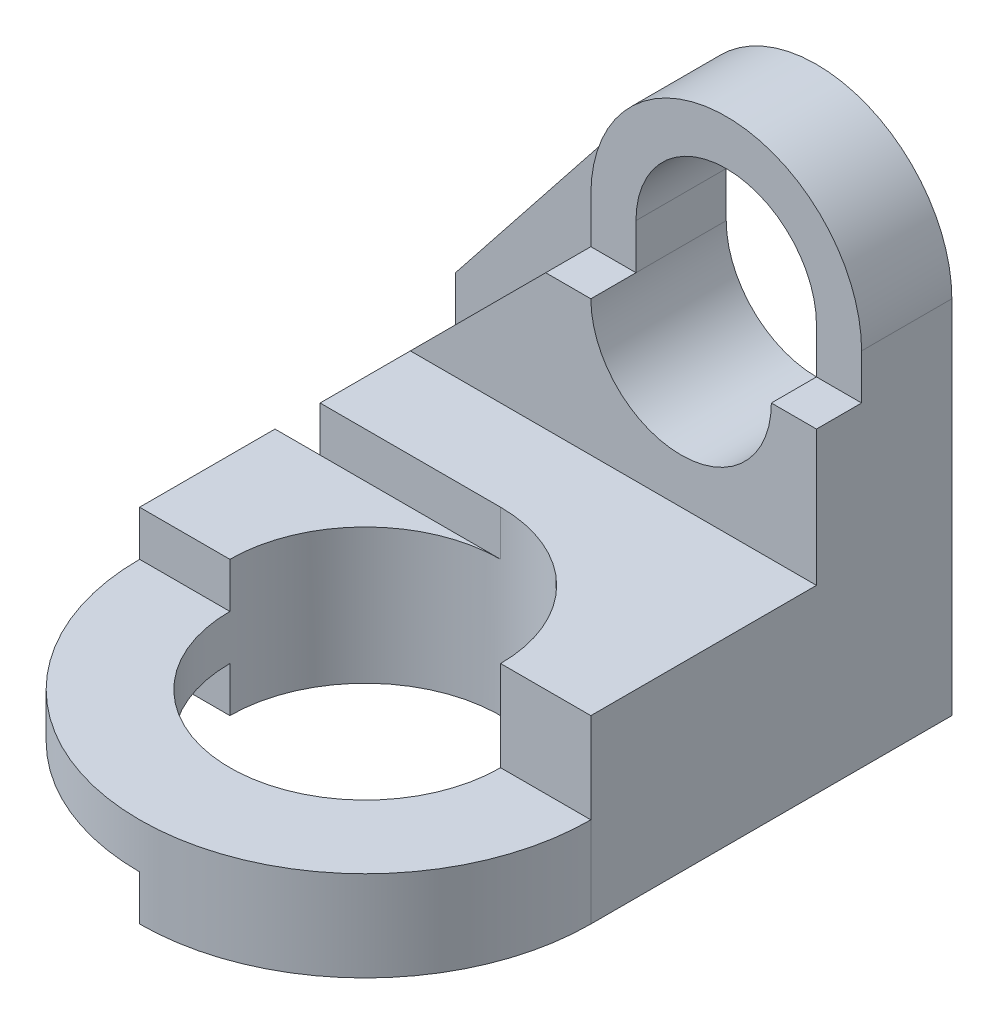
ISO-10303-21;
HEADER;
FILE_DESCRIPTION(('STEP AP214'),'2;1');
FILE_NAME('part.step','',(''),(''),'','','');
FILE_SCHEMA(('AUTOMOTIVE_DESIGN { 1 0 10303 214 1 1 1 1 }'));
ENDSEC;
DATA;
#1=APPLICATION_CONTEXT('core data for automotive mechanical design processes');
#2=APPLICATION_PROTOCOL_DEFINITION('international standard','automotive_design',2000,#1);
#3=PRODUCT_CONTEXT('',#1,'mechanical');
#4=PRODUCT('Part','Part','',(#3));
#5=PRODUCT_RELATED_PRODUCT_CATEGORY('part','',(#4));
#6=PRODUCT_DEFINITION_FORMATION('','',#4);
#7=PRODUCT_DEFINITION_CONTEXT('part definition',#1,'design');
#8=PRODUCT_DEFINITION('design','',#6,#7);
#9=PRODUCT_DEFINITION_SHAPE('','',#8);
#10=(LENGTH_UNIT() NAMED_UNIT(*) SI_UNIT(.MILLI.,.METRE.));
#11=(NAMED_UNIT(*) PLANE_ANGLE_UNIT() SI_UNIT($,.RADIAN.));
#12=(NAMED_UNIT(*) SI_UNIT($,.STERADIAN.) SOLID_ANGLE_UNIT());
#13=UNCERTAINTY_MEASURE_WITH_UNIT(LENGTH_MEASURE(1.E-05),#10,'distance_accuracy_value','');
#14=(GEOMETRIC_REPRESENTATION_CONTEXT(3) GLOBAL_UNCERTAINTY_ASSIGNED_CONTEXT((#13)) GLOBAL_UNIT_ASSIGNED_CONTEXT((#10,
#11,#12)) REPRESENTATION_CONTEXT('',''));
#15=CARTESIAN_POINT('',(0.,0.,0.));
#16=DIRECTION('',(0.,0.,1.));
#17=DIRECTION('',(1.,0.,0.));
#18=AXIS2_PLACEMENT_3D('',#15,#16,#17);
#19=CARTESIAN_POINT('',(0.,3.,13.));
#20=DIRECTION('',(0.,-1.,0.));
#21=DIRECTION('',(0.,0.,-1.));
#22=AXIS2_PLACEMENT_3D('',#19,#20,#21);
#23=PLANE('',#22);
#24=DIRECTION('',(0.,0.,-1.));
#25=VECTOR('',#24,1.);
#26=CARTESIAN_POINT('',(0.,3.,13.));
#27=LINE('',#26,#25);
#28=CARTESIAN_POINT('',(0.,3.,8.00000000000004));
#29=VERTEX_POINT('',#28);
#30=CARTESIAN_POINT('',(0.,3.,5.));
#31=VERTEX_POINT('',#30);
#32=EDGE_CURVE('E592',#29,#31,#27,.T.);
#33=ORIENTED_EDGE('',*,*,#32,.F.);
#34=DIRECTION('',(-1.,0.,0.));
#35=VECTOR('',#34,1.);
#36=CARTESIAN_POINT('',(0.,3.,8.00000000000004));
#37=LINE('',#36,#35);
#38=CARTESIAN_POINT('',(2.,3.,8.));
#39=VERTEX_POINT('',#38);
#40=EDGE_CURVE('E262',#39,#29,#37,.T.);
#41=ORIENTED_EDGE('',*,*,#40,.F.);
#42=CARTESIAN_POINT('',(5.,3.,8.));
#43=DIRECTION('',(0.,-1.,0.));
#44=DIRECTION('',(0.,0.,-1.));
#45=AXIS2_PLACEMENT_3D('',#42,#43,#44);
#46=CIRCLE('',#45,3.);
#47=CARTESIAN_POINT('',(4.99999999999999,3.,5.));
#48=VERTEX_POINT('',#47);
#49=EDGE_CURVE('E292',#39,#48,#46,.T.);
#50=ORIENTED_EDGE('',*,*,#49,.T.);
#51=DIRECTION('',(-1.,0.,0.));
#52=VECTOR('',#51,1.);
#53=CARTESIAN_POINT('',(0.,3.,5.));
#54=LINE('',#53,#52);
#55=CARTESIAN_POINT('',(1.,3.,5.));
#56=VERTEX_POINT('',#55);
#57=EDGE_CURVE('E54',#48,#56,#54,.T.);
#58=ORIENTED_EDGE('',*,*,#57,.T.);
#59=EDGE_CURVE('E317',#56,#31,#54,.T.);
#60=ORIENTED_EDGE('',*,*,#59,.T.);
#61=EDGE_LOOP('',(#33,#41,#50,#58,#60));
#62=FACE_BOUND('',#61,.T.);
#63=ADVANCED_FACE('F50',(#62),#23,.F.);
#64=CARTESIAN_POINT('',(5.,-4.,8.));
#65=DIRECTION('',(0.,1.,0.));
#66=DIRECTION('',(0.,0.,1.));
#67=AXIS2_PLACEMENT_3D('',#64,#65,#66);
#68=CYLINDRICAL_SURFACE('',#67,5.);
#69=DIRECTION('',(0.,1.,0.));
#70=VECTOR('',#69,1.);
#71=CARTESIAN_POINT('',(10.,-4.,8.));
#72=LINE('',#71,#70);
#73=CARTESIAN_POINT('',(10.,0.,8.));
#74=VERTEX_POINT('',#73);
#75=CARTESIAN_POINT('',(10.,2.,8.));
#76=VERTEX_POINT('',#75);
#77=EDGE_CURVE('E303',#74,#76,#72,.T.);
#78=ORIENTED_EDGE('',*,*,#77,.T.);
#79=CARTESIAN_POINT('',(5.,2.,8.));
#80=DIRECTION('',(0.,1.,0.));
#81=DIRECTION('',(0.,0.,1.));
#82=AXIS2_PLACEMENT_3D('',#79,#80,#81);
#83=CIRCLE('',#82,5.);
#84=CARTESIAN_POINT('',(0.,2.,8.00000000000004));
#85=VERTEX_POINT('',#84);
#86=EDGE_CURVE('E263',#85,#76,#83,.T.);
#87=ORIENTED_EDGE('',*,*,#86,.F.);
#88=DIRECTION('',(0.,1.,0.));
#89=VECTOR('',#88,1.);
#90=CARTESIAN_POINT('',(0.,-4.,8.));
#91=LINE('',#90,#89);
#92=CARTESIAN_POINT('',(0.,1.,7.99999999999997));
#93=VERTEX_POINT('',#92);
#94=EDGE_CURVE('E302',#93,#85,#91,.T.);
#95=ORIENTED_EDGE('',*,*,#94,.F.);
#96=CARTESIAN_POINT('',(4.99999999999999,1.,8.));
#97=DIRECTION('',(0.,-1.,0.));
#98=DIRECTION('',(1.,0.,0.));
#99=AXIS2_PLACEMENT_3D('',#96,#97,#98);
#100=CIRCLE('',#99,5.);
#101=CARTESIAN_POINT('',(5.,1.,13.));
#102=VERTEX_POINT('',#101);
#103=EDGE_CURVE('E277',#102,#93,#100,.T.);
#104=ORIENTED_EDGE('',*,*,#103,.F.);
#105=DIRECTION('',(0.,-1.,0.));
#106=VECTOR('',#105,1.);
#107=CARTESIAN_POINT('',(5.,1.,13.));
#108=LINE('',#107,#106);
#109=CARTESIAN_POINT('',(5.,0.,13.));
#110=VERTEX_POINT('',#109);
#111=EDGE_CURVE('E289',#102,#110,#108,.T.);
#112=ORIENTED_EDGE('',*,*,#111,.T.);
#113=CARTESIAN_POINT('',(5.,0.,8.));
#114=DIRECTION('',(0.,-1.,0.));
#115=DIRECTION('',(1.,0.,0.));
#116=AXIS2_PLACEMENT_3D('',#113,#114,#115);
#117=CIRCLE('',#116,5.);
#118=EDGE_CURVE('E306',#74,#110,#117,.T.);
#119=ORIENTED_EDGE('',*,*,#118,.F.);
#120=EDGE_LOOP('',(#78,#87,#95,#104,#112,#119));
#121=FACE_BOUND('',#120,.T.);
#122=ADVANCED_FACE('F539',(#121),#68,.T.);
#123=CARTESIAN_POINT('',(0.,0.,1.));
#124=DIRECTION('',(0.,-1.,0.));
#125=DIRECTION('',(1.,0.,0.));
#126=AXIS2_PLACEMENT_3D('',#123,#124,#125);
#127=PLANE('',#126);
#128=DIRECTION('',(0.,0.,1.));
#129=VECTOR('',#128,1.);
#130=CARTESIAN_POINT('',(5.,0.,11.));
#131=LINE('',#130,#129);
#132=CARTESIAN_POINT('',(5.,0.,11.));
#133=VERTEX_POINT('',#132);
#134=EDGE_CURVE('E279',#133,#110,#131,.T.);
#135=ORIENTED_EDGE('',*,*,#134,.F.);
#136=CARTESIAN_POINT('',(5.,0.,8.));
#137=DIRECTION('',(0.,-1.,0.));
#138=DIRECTION('',(1.,0.,0.));
#139=AXIS2_PLACEMENT_3D('',#136,#137,#138);
#140=CIRCLE('',#139,3.);
#141=CARTESIAN_POINT('',(2.,0.,8.));
#142=VERTEX_POINT('',#141);
#143=EDGE_CURVE('E299',#142,#133,#140,.T.);
#144=ORIENTED_EDGE('',*,*,#143,.F.);
#145=DIRECTION('',(1.,0.,0.));
#146=VECTOR('',#145,1.);
#147=CARTESIAN_POINT('',(2.,0.,8.));
#148=LINE('',#147,#146);
#149=CARTESIAN_POINT('',(0.,0.,7.99999999999997));
#150=VERTEX_POINT('',#149);
#151=EDGE_CURVE('E274',#150,#142,#148,.T.);
#152=ORIENTED_EDGE('',*,*,#151,.F.);
#153=DIRECTION('',(0.,0.,-1.));
#154=VECTOR('',#153,1.);
#155=CARTESIAN_POINT('',(0.,0.,13.));
#156=LINE('',#155,#154);
#157=CARTESIAN_POINT('',(0.,0.,5.));
#158=VERTEX_POINT('',#157);
#159=EDGE_CURVE('E324',#150,#158,#156,.T.);
#160=ORIENTED_EDGE('',*,*,#159,.T.);
#161=DIRECTION('',(1.,0.,0.));
#162=VECTOR('',#161,1.);
#163=CARTESIAN_POINT('',(0.,0.,5.));
#164=LINE('',#163,#162);
#165=CARTESIAN_POINT('',(1.,0.,5.));
#166=VERTEX_POINT('',#165);
#167=EDGE_CURVE('E315',#158,#166,#164,.T.);
#168=ORIENTED_EDGE('',*,*,#167,.T.);
#169=DIRECTION('',(0.,0.,-1.));
#170=VECTOR('',#169,1.);
#171=CARTESIAN_POINT('',(1.,0.,3.));
#172=LINE('',#171,#170);
#173=CARTESIAN_POINT('',(1.,0.,1.));
#174=VERTEX_POINT('',#173);
#175=EDGE_CURVE('E358',#166,#174,#172,.T.);
#176=ORIENTED_EDGE('',*,*,#175,.T.);
#177=DIRECTION('',(-1.,0.,0.));
#178=VECTOR('',#177,1.);
#179=CARTESIAN_POINT('',(0.,0.,1.));
#180=LINE('',#179,#178);
#181=CARTESIAN_POINT('',(0.,0.,1.));
#182=VERTEX_POINT('',#181);
#183=EDGE_CURVE('E391',#174,#182,#180,.T.);
#184=ORIENTED_EDGE('',*,*,#183,.T.);
#185=DIRECTION('',(0.,0.,-1.));
#186=VECTOR('',#185,1.);
#187=CARTESIAN_POINT('',(0.,0.,1.));
#188=LINE('',#187,#186);
#189=CARTESIAN_POINT('',(0.,0.,0.));
#190=VERTEX_POINT('',#189);
#191=EDGE_CURVE('E430',#182,#190,#188,.T.);
#192=ORIENTED_EDGE('',*,*,#191,.T.);
#193=DIRECTION('',(-1.,0.,0.));
#194=VECTOR('',#193,1.);
#195=CARTESIAN_POINT('',(0.,0.,0.));
#196=LINE('',#195,#194);
#197=CARTESIAN_POINT('',(10.,0.,0.));
#198=VERTEX_POINT('',#197);
#199=EDGE_CURVE('E380',#198,#190,#196,.T.);
#200=ORIENTED_EDGE('',*,*,#199,.F.);
#201=DIRECTION('',(0.,0.,-1.));
#202=VECTOR('',#201,1.);
#203=CARTESIAN_POINT('',(10.,0.,1.));
#204=LINE('',#203,#202);
#205=EDGE_CURVE('E428',#74,#198,#204,.T.);
#206=ORIENTED_EDGE('',*,*,#205,.F.);
#207=ORIENTED_EDGE('',*,*,#118,.T.);
#208=EDGE_LOOP('',(#135,#144,#152,#160,#168,#176,#184,#192,#200,#206,#207));
#209=FACE_BOUND('',#208,.T.);
#210=ADVANCED_FACE('F546',(#209),#127,.T.);
#211=CARTESIAN_POINT('',(0.,0.,1.));
#212=DIRECTION('',(0.,0.,1.));
#213=DIRECTION('',(1.,0.,0.));
#214=AXIS2_PLACEMENT_3D('',#211,#212,#213);
#215=PLANE('',#214);
#216=ORIENTED_EDGE('',*,*,#183,.F.);
#217=DIRECTION('',(0.,1.,0.));
#218=VECTOR('',#217,1.);
#219=CARTESIAN_POINT('',(1.,0.,1.));
#220=LINE('',#219,#218);
#221=CARTESIAN_POINT('',(1.,4.,1.));
#222=VERTEX_POINT('',#221);
#223=EDGE_CURVE('E346',#174,#222,#220,.T.);
#224=ORIENTED_EDGE('',*,*,#223,.T.);
#225=DIRECTION('',(0.707106781186547,0.707106781186548,0.));
#226=VECTOR('',#225,1.);
#227=CARTESIAN_POINT('',(-1.5,1.5,1.));
#228=LINE('',#227,#226);
#229=CARTESIAN_POINT('',(4.,7.,1.));
#230=VERTEX_POINT('',#229);
#231=EDGE_CURVE('E362',#222,#230,#228,.T.);
#232=ORIENTED_EDGE('',*,*,#231,.T.);
#233=DIRECTION('',(0.,1.,0.));
#234=VECTOR('',#233,1.);
#235=CARTESIAN_POINT('',(3.99999999999999,0.,1.));
#236=LINE('',#235,#234);
#237=CARTESIAN_POINT('',(4.,8.,1.));
#238=VERTEX_POINT('',#237);
#239=EDGE_CURVE('E359',#230,#238,#236,.T.);
#240=ORIENTED_EDGE('',*,*,#239,.T.);
#241=CARTESIAN_POINT('',(7.,8.,1.));
#242=DIRECTION('',(0.,0.,1.));
#243=DIRECTION('',(1.,0.,0.));
#244=AXIS2_PLACEMENT_3D('',#241,#242,#243);
#245=CIRCLE('',#244,2.99999999999999);
#246=CARTESIAN_POINT('',(4.6492341956527,9.86384015760778,1.));
#247=VERTEX_POINT('',#246);
#248=EDGE_CURVE('E60',#247,#238,#245,.T.);
#249=ORIENTED_EDGE('',*,*,#248,.F.);
#250=DIRECTION('',(0.621280052535926,0.7835886014491,0.));
#251=VECTOR('',#250,1.);
#252=CARTESIAN_POINT('',(-1.9473118698994,1.54395561471617,1.));
#253=LINE('',#252,#251);
#254=CARTESIAN_POINT('',(0.,4.,1.));
#255=VERTEX_POINT('',#254);
#256=EDGE_CURVE('E376',#255,#247,#253,.T.);
#257=ORIENTED_EDGE('',*,*,#256,.F.);
#258=DIRECTION('',(0.,1.,0.));
#259=VECTOR('',#258,1.);
#260=CARTESIAN_POINT('',(0.,0.,1.));
#261=LINE('',#260,#259);
#262=EDGE_CURVE('E379',#182,#255,#261,.T.);
#263=ORIENTED_EDGE('',*,*,#262,.F.);
#264=EDGE_LOOP('',(#216,#224,#232,#240,#249,#257,#263));
#265=FACE_BOUND('',#264,.T.);
#266=ADVANCED_FACE('F509',(#265),#215,.T.);
#267=CARTESIAN_POINT('',(10.,0.,1.));
#268=DIRECTION('',(1.,0.,0.));
#269=DIRECTION('',(0.,1.,0.));
#270=AXIS2_PLACEMENT_3D('',#267,#268,#269);
#271=PLANE('',#270);
#272=ORIENTED_EDGE('',*,*,#77,.F.);
#273=ORIENTED_EDGE('',*,*,#205,.T.);
#274=DIRECTION('',(0.,-1.,0.));
#275=VECTOR('',#274,1.);
#276=CARTESIAN_POINT('',(10.,0.,0.));
#277=LINE('',#276,#275);
#278=CARTESIAN_POINT('',(9.99999999999999,8.,0.));
#279=VERTEX_POINT('',#278);
#280=EDGE_CURVE('E414',#279,#198,#277,.T.);
#281=ORIENTED_EDGE('',*,*,#280,.F.);
#282=DIRECTION('',(0.,0.,-1.));
#283=VECTOR('',#282,1.);
#284=CARTESIAN_POINT('',(9.99999999999999,8.,1.));
#285=LINE('',#284,#283);
#286=CARTESIAN_POINT('',(9.99999999999999,8.,2.));
#287=VERTEX_POINT('',#286);
#288=EDGE_CURVE('E385',#287,#279,#285,.T.);
#289=ORIENTED_EDGE('',*,*,#288,.F.);
#290=DIRECTION('',(0.,1.,0.));
#291=VECTOR('',#290,1.);
#292=CARTESIAN_POINT('',(10.,0.,2.));
#293=LINE('',#292,#291);
#294=CARTESIAN_POINT('',(9.99999999999999,7.,2.));
#295=VERTEX_POINT('',#294);
#296=EDGE_CURVE('E351',#295,#287,#293,.T.);
#297=ORIENTED_EDGE('',*,*,#296,.F.);
#298=DIRECTION('',(0.,0.,-1.));
#299=VECTOR('',#298,1.);
#300=CARTESIAN_POINT('',(9.99999999999999,7.,1.));
#301=LINE('',#300,#299);
#302=CARTESIAN_POINT('',(10.,7.,3.));
#303=VERTEX_POINT('',#302);
#304=EDGE_CURVE('E464',#303,#295,#301,.T.);
#305=ORIENTED_EDGE('',*,*,#304,.F.);
#306=DIRECTION('',(0.,1.,0.));
#307=VECTOR('',#306,1.);
#308=CARTESIAN_POINT('',(10.,0.,3.));
#309=LINE('',#308,#307);
#310=CARTESIAN_POINT('',(9.99999999999999,4.,3.));
#311=VERTEX_POINT('',#310);
#312=EDGE_CURVE('E343',#311,#303,#309,.T.);
#313=ORIENTED_EDGE('',*,*,#312,.F.);
#314=DIRECTION('',(0.,0.,-1.));
#315=VECTOR('',#314,1.);
#316=CARTESIAN_POINT('',(10.,4.,5.));
#317=LINE('',#316,#315);
#318=CARTESIAN_POINT('',(10.,4.,8.));
#319=VERTEX_POINT('',#318);
#320=EDGE_CURVE('E336',#319,#311,#317,.T.);
#321=ORIENTED_EDGE('',*,*,#320,.F.);
#322=DIRECTION('',(0.,1.,0.));
#323=VECTOR('',#322,1.);
#324=CARTESIAN_POINT('',(10.,2.,8.));
#325=LINE('',#324,#323);
#326=EDGE_CURVE('E243',#76,#319,#325,.T.);
#327=ORIENTED_EDGE('',*,*,#326,.F.);
#328=EDGE_LOOP('',(#272,#273,#281,#289,#297,#305,#313,#321,#327));
#329=FACE_BOUND('',#328,.T.);
#330=ADVANCED_FACE('F496',(#329),#271,.T.);
#331=CARTESIAN_POINT('',(7.,8.,1.));
#332=DIRECTION('',(0.,0.,-1.));
#333=DIRECTION('',(-1.,0.,0.));
#334=AXIS2_PLACEMENT_3D('',#331,#332,#333);
#335=CYLINDRICAL_SURFACE('',#334,2.99999999999999);
#336=DIRECTION('',(0.,0.,-1.));
#337=VECTOR('',#336,1.);
#338=CARTESIAN_POINT('',(4.,8.,3.));
#339=LINE('',#338,#337);
#340=CARTESIAN_POINT('',(4.,8.,2.));
#341=VERTEX_POINT('',#340);
#342=EDGE_CURVE('E405',#341,#238,#339,.T.);
#343=ORIENTED_EDGE('',*,*,#342,.F.);
#344=CARTESIAN_POINT('',(7.,8.,2.));
#345=DIRECTION('',(0.,0.,-1.));
#346=DIRECTION('',(-1.,0.,0.));
#347=AXIS2_PLACEMENT_3D('',#344,#345,#346);
#348=CIRCLE('',#347,2.99999999999999);
#349=EDGE_CURVE('E468',#341,#287,#348,.T.);
#350=ORIENTED_EDGE('',*,*,#349,.T.);
#351=ORIENTED_EDGE('',*,*,#288,.T.);
#352=CARTESIAN_POINT('',(7.,8.,0.));
#353=DIRECTION('',(0.,0.,1.));
#354=DIRECTION('',(1.,0.,0.));
#355=AXIS2_PLACEMENT_3D('',#352,#353,#354);
#356=CIRCLE('',#355,2.99999999999999);
#357=CARTESIAN_POINT('',(4.6492341956527,9.86384015760778,0.));
#358=VERTEX_POINT('',#357);
#359=EDGE_CURVE('E417',#279,#358,#356,.T.);
#360=ORIENTED_EDGE('',*,*,#359,.T.);
#361=DIRECTION('',(0.,0.,-1.));
#362=VECTOR('',#361,1.);
#363=CARTESIAN_POINT('',(4.6492341956527,9.86384015760778,1.));
#364=LINE('',#363,#362);
#365=EDGE_CURVE('E383',#247,#358,#364,.T.);
#366=ORIENTED_EDGE('',*,*,#365,.F.);
#367=ORIENTED_EDGE('',*,*,#248,.T.);
#368=EDGE_LOOP('',(#343,#350,#351,#360,#366,#367));
#369=FACE_BOUND('',#368,.T.);
#370=ADVANCED_FACE('F500',(#369),#335,.T.);
#371=CARTESIAN_POINT('',(-1.9473118698994,1.54395561471617,1.));
#372=DIRECTION('',(-0.7835886014491,0.621280052535926,0.));
#373=DIRECTION('',(-0.621280052535926,-0.7835886014491,0.));
#374=AXIS2_PLACEMENT_3D('',#371,#372,#373);
#375=PLANE('',#374);
#376=DIRECTION('',(0.621280052535926,0.7835886014491,0.));
#377=VECTOR('',#376,1.);
#378=CARTESIAN_POINT('',(-1.9473118698994,1.54395561471617,0.));
#379=LINE('',#378,#377);
#380=CARTESIAN_POINT('',(0.,4.,0.));
#381=VERTEX_POINT('',#380);
#382=EDGE_CURVE('E420',#381,#358,#379,.T.);
#383=ORIENTED_EDGE('',*,*,#382,.F.);
#384=DIRECTION('',(0.,0.,-1.));
#385=VECTOR('',#384,1.);
#386=CARTESIAN_POINT('',(0.,4.,1.));
#387=LINE('',#386,#385);
#388=EDGE_CURVE('E386',#255,#381,#387,.T.);
#389=ORIENTED_EDGE('',*,*,#388,.F.);
#390=ORIENTED_EDGE('',*,*,#256,.T.);
#391=ORIENTED_EDGE('',*,*,#365,.T.);
#392=EDGE_LOOP('',(#383,#389,#390,#391));
#393=FACE_BOUND('',#392,.T.);
#394=ADVANCED_FACE('F506',(#393),#375,.T.);
#395=CARTESIAN_POINT('',(0.,0.,1.));
#396=DIRECTION('',(-1.,0.,0.));
#397=DIRECTION('',(0.,0.,1.));
#398=AXIS2_PLACEMENT_3D('',#395,#396,#397);
#399=PLANE('',#398);
#400=DIRECTION('',(0.,1.,0.));
#401=VECTOR('',#400,1.);
#402=CARTESIAN_POINT('',(0.,0.,0.));
#403=LINE('',#402,#401);
#404=EDGE_CURVE('E423',#190,#381,#403,.T.);
#405=ORIENTED_EDGE('',*,*,#404,.F.);
#406=ORIENTED_EDGE('',*,*,#191,.F.);
#407=ORIENTED_EDGE('',*,*,#262,.T.);
#408=ORIENTED_EDGE('',*,*,#388,.T.);
#409=EDGE_LOOP('',(#405,#406,#407,#408));
#410=FACE_BOUND('',#409,.T.);
#411=ADVANCED_FACE('F585',(#410),#399,.T.);
#412=CARTESIAN_POINT('',(7.,7.,1.));
#413=DIRECTION('',(0.,0.,-1.));
#414=DIRECTION('',(-1.,0.,0.));
#415=AXIS2_PLACEMENT_3D('',#412,#413,#414);
#416=CYLINDRICAL_SURFACE('',#415,2.);
#417=CARTESIAN_POINT('',(7.,7.,0.));
#418=DIRECTION('',(0.,0.,1.));
#419=DIRECTION('',(1.,0.,0.));
#420=AXIS2_PLACEMENT_3D('',#417,#418,#419);
#421=CIRCLE('',#420,2.);
#422=CARTESIAN_POINT('',(5.,7.,0.));
#423=VERTEX_POINT('',#422);
#424=CARTESIAN_POINT('',(9.,7.,0.));
#425=VERTEX_POINT('',#424);
#426=EDGE_CURVE('E401',#423,#425,#421,.T.);
#427=ORIENTED_EDGE('',*,*,#426,.F.);
#428=DIRECTION('',(0.,0.,-1.));
#429=VECTOR('',#428,1.);
#430=CARTESIAN_POINT('',(5.,7.,1.));
#431=LINE('',#430,#429);
#432=CARTESIAN_POINT('',(5.,7.,2.));
#433=VERTEX_POINT('',#432);
#434=EDGE_CURVE('E439',#433,#423,#431,.T.);
#435=ORIENTED_EDGE('',*,*,#434,.F.);
#436=CARTESIAN_POINT('',(5.,7.,3.));
#437=VERTEX_POINT('',#436);
#438=EDGE_CURVE('E395',#437,#433,#431,.T.);
#439=ORIENTED_EDGE('',*,*,#438,.F.);
#440=CARTESIAN_POINT('',(7.,7.,3.));
#441=DIRECTION('',(0.,0.,1.));
#442=DIRECTION('',(1.,0.,0.));
#443=AXIS2_PLACEMENT_3D('',#440,#441,#442);
#444=CIRCLE('',#443,2.);
#445=CARTESIAN_POINT('',(9.,7.,3.));
#446=VERTEX_POINT('',#445);
#447=EDGE_CURVE('E355',#446,#437,#444,.F.);
#448=ORIENTED_EDGE('',*,*,#447,.F.);
#449=DIRECTION('',(0.,0.,-1.));
#450=VECTOR('',#449,1.);
#451=CARTESIAN_POINT('',(9.,7.,1.));
#452=LINE('',#451,#450);
#453=CARTESIAN_POINT('',(9.,7.,2.));
#454=VERTEX_POINT('',#453);
#455=EDGE_CURVE('E434',#446,#454,#452,.T.);
#456=ORIENTED_EDGE('',*,*,#455,.T.);
#457=EDGE_CURVE('E394',#454,#425,#452,.T.);
#458=ORIENTED_EDGE('',*,*,#457,.T.);
#459=EDGE_LOOP('',(#427,#435,#439,#448,#456,#458));
#460=FACE_BOUND('',#459,.T.);
#461=ADVANCED_FACE('F52',(#460),#416,.F.);
#462=CARTESIAN_POINT('',(5.00000000000001,0.,1.));
#463=DIRECTION('',(1.,0.,0.));
#464=DIRECTION('',(0.,1.,0.));
#465=AXIS2_PLACEMENT_3D('',#462,#463,#464);
#466=PLANE('',#465);
#467=DIRECTION('',(0.,1.,0.));
#468=VECTOR('',#467,1.);
#469=CARTESIAN_POINT('',(5.00000000000001,0.,2.));
#470=LINE('',#469,#468);
#471=CARTESIAN_POINT('',(5.,8.,2.));
#472=VERTEX_POINT('',#471);
#473=EDGE_CURVE('E461',#433,#472,#470,.T.);
#474=ORIENTED_EDGE('',*,*,#473,.F.);
#475=ORIENTED_EDGE('',*,*,#434,.T.);
#476=DIRECTION('',(0.,-1.,0.));
#477=VECTOR('',#476,1.);
#478=CARTESIAN_POINT('',(5.00000000000001,0.,0.));
#479=LINE('',#478,#477);
#480=CARTESIAN_POINT('',(5.,8.,0.));
#481=VERTEX_POINT('',#480);
#482=EDGE_CURVE('E404',#481,#423,#479,.T.);
#483=ORIENTED_EDGE('',*,*,#482,.F.);
#484=DIRECTION('',(0.,0.,-1.));
#485=VECTOR('',#484,1.);
#486=CARTESIAN_POINT('',(5.,8.,1.));
#487=LINE('',#486,#485);
#488=EDGE_CURVE('E438',#472,#481,#487,.T.);
#489=ORIENTED_EDGE('',*,*,#488,.F.);
#490=EDGE_LOOP('',(#474,#475,#483,#489));
#491=FACE_BOUND('',#490,.T.);
#492=ADVANCED_FACE('F467',(#491),#466,.T.);
#493=CARTESIAN_POINT('',(7.,8.,1.));
#494=DIRECTION('',(0.,0.,-1.));
#495=DIRECTION('',(-1.,0.,0.));
#496=AXIS2_PLACEMENT_3D('',#493,#494,#495);
#497=CYLINDRICAL_SURFACE('',#496,2.);
#498=CARTESIAN_POINT('',(7.,8.,2.));
#499=DIRECTION('',(0.,0.,-1.));
#500=DIRECTION('',(-1.,0.,0.));
#501=AXIS2_PLACEMENT_3D('',#498,#499,#500);
#502=CIRCLE('',#501,2.);
#503=CARTESIAN_POINT('',(9.,8.,2.));
#504=VERTEX_POINT('',#503);
#505=EDGE_CURVE('E469',#472,#504,#502,.T.);
#506=ORIENTED_EDGE('',*,*,#505,.F.);
#507=ORIENTED_EDGE('',*,*,#488,.T.);
#508=CARTESIAN_POINT('',(7.,8.,0.));
#509=DIRECTION('',(0.,0.,1.));
#510=DIRECTION('',(1.,0.,0.));
#511=AXIS2_PLACEMENT_3D('',#508,#509,#510);
#512=CIRCLE('',#511,2.);
#513=CARTESIAN_POINT('',(9.,8.,0.));
#514=VERTEX_POINT('',#513);
#515=EDGE_CURVE('E408',#514,#481,#512,.T.);
#516=ORIENTED_EDGE('',*,*,#515,.F.);
#517=DIRECTION('',(0.,0.,-1.));
#518=VECTOR('',#517,1.);
#519=CARTESIAN_POINT('',(9.,8.,1.));
#520=LINE('',#519,#518);
#521=EDGE_CURVE('E437',#504,#514,#520,.T.);
#522=ORIENTED_EDGE('',*,*,#521,.F.);
#523=EDGE_LOOP('',(#506,#507,#516,#522));
#524=FACE_BOUND('',#523,.T.);
#525=ADVANCED_FACE('F477',(#524),#497,.F.);
#526=CARTESIAN_POINT('',(8.99999999999999,0.,1.));
#527=DIRECTION('',(1.,0.,0.));
#528=DIRECTION('',(0.,1.,0.));
#529=AXIS2_PLACEMENT_3D('',#526,#527,#528);
#530=PLANE('',#529);
#531=ORIENTED_EDGE('',*,*,#457,.F.);
#532=DIRECTION('',(0.,1.,0.));
#533=VECTOR('',#532,1.);
#534=CARTESIAN_POINT('',(8.99999999999999,0.,2.));
#535=LINE('',#534,#533);
#536=EDGE_CURVE('E481',#454,#504,#535,.T.);
#537=ORIENTED_EDGE('',*,*,#536,.T.);
#538=ORIENTED_EDGE('',*,*,#521,.T.);
#539=DIRECTION('',(0.,-1.,0.));
#540=VECTOR('',#539,1.);
#541=CARTESIAN_POINT('',(8.99999999999999,0.,0.));
#542=LINE('',#541,#540);
#543=EDGE_CURVE('E411',#514,#425,#542,.T.);
#544=ORIENTED_EDGE('',*,*,#543,.T.);
#545=EDGE_LOOP('',(#531,#537,#538,#544));
#546=FACE_BOUND('',#545,.T.);
#547=ADVANCED_FACE('F480',(#546),#530,.F.);
#548=CARTESIAN_POINT('',(0.,0.,0.));
#549=DIRECTION('',(0.,0.,1.));
#550=DIRECTION('',(1.,0.,0.));
#551=AXIS2_PLACEMENT_3D('',#548,#549,#550);
#552=PLANE('',#551);
#553=ORIENTED_EDGE('',*,*,#426,.T.);
#554=ORIENTED_EDGE('',*,*,#543,.F.);
#555=ORIENTED_EDGE('',*,*,#515,.T.);
#556=ORIENTED_EDGE('',*,*,#482,.T.);
#557=EDGE_LOOP('',(#553,#554,#555,#556));
#558=FACE_BOUND('',#557,.T.);
#559=ORIENTED_EDGE('',*,*,#280,.T.);
#560=ORIENTED_EDGE('',*,*,#199,.T.);
#561=ORIENTED_EDGE('',*,*,#404,.T.);
#562=ORIENTED_EDGE('',*,*,#382,.T.);
#563=ORIENTED_EDGE('',*,*,#359,.F.);
#564=EDGE_LOOP('',(#559,#560,#561,#562,#563));
#565=FACE_BOUND('',#564,.T.);
#566=ADVANCED_FACE('F474',(#558,#565),#552,.F.);
#567=CARTESIAN_POINT('',(3.99999999999999,0.,3.));
#568=DIRECTION('',(-1.,0.,0.));
#569=DIRECTION('',(0.,-1.,0.));
#570=AXIS2_PLACEMENT_3D('',#567,#568,#569);
#571=PLANE('',#570);
#572=DIRECTION('',(0.,-1.,0.));
#573=VECTOR('',#572,1.);
#574=CARTESIAN_POINT('',(4.,7.,2.));
#575=LINE('',#574,#573);
#576=CARTESIAN_POINT('',(4.,7.,2.));
#577=VERTEX_POINT('',#576);
#578=EDGE_CURVE('E463',#341,#577,#575,.T.);
#579=ORIENTED_EDGE('',*,*,#578,.F.);
#580=ORIENTED_EDGE('',*,*,#342,.T.);
#581=ORIENTED_EDGE('',*,*,#239,.F.);
#582=DIRECTION('',(0.,0.,-1.));
#583=VECTOR('',#582,1.);
#584=CARTESIAN_POINT('',(4.,7.,3.));
#585=LINE('',#584,#583);
#586=EDGE_CURVE('E516',#577,#230,#585,.T.);
#587=ORIENTED_EDGE('',*,*,#586,.F.);
#588=EDGE_LOOP('',(#579,#580,#581,#587));
#589=FACE_BOUND('',#588,.T.);
#590=ADVANCED_FACE('F515',(#589),#571,.T.);
#591=CARTESIAN_POINT('',(-1.5,1.5,3.));
#592=DIRECTION('',(-0.707106781186548,0.707106781186547,0.));
#593=DIRECTION('',(-0.707106781186547,-0.707106781186548,0.));
#594=AXIS2_PLACEMENT_3D('',#591,#592,#593);
#595=PLANE('',#594);
#596=ORIENTED_EDGE('',*,*,#231,.F.);
#597=DIRECTION('',(0.,0.,-1.));
#598=VECTOR('',#597,1.);
#599=CARTESIAN_POINT('',(1.,4.,3.));
#600=LINE('',#599,#598);
#601=CARTESIAN_POINT('',(1.,4.,3.));
#602=VERTEX_POINT('',#601);
#603=EDGE_CURVE('E367',#602,#222,#600,.T.);
#604=ORIENTED_EDGE('',*,*,#603,.F.);
#605=DIRECTION('',(0.707106781186547,0.707106781186548,0.));
#606=VECTOR('',#605,1.);
#607=CARTESIAN_POINT('',(-1.5,1.5,3.));
#608=LINE('',#607,#606);
#609=CARTESIAN_POINT('',(4.,7.,3.));
#610=VERTEX_POINT('',#609);
#611=EDGE_CURVE('E345',#602,#610,#608,.T.);
#612=ORIENTED_EDGE('',*,*,#611,.T.);
#613=EDGE_CURVE('E518',#610,#577,#585,.T.);
#614=ORIENTED_EDGE('',*,*,#613,.T.);
#615=ORIENTED_EDGE('',*,*,#586,.T.);
#616=EDGE_LOOP('',(#596,#604,#612,#614,#615));
#617=FACE_BOUND('',#616,.T.);
#618=ADVANCED_FACE('F527',(#617),#595,.T.);
#619=CARTESIAN_POINT('',(1.,0.,3.));
#620=DIRECTION('',(-1.,0.,0.));
#621=DIRECTION('',(0.,-1.,0.));
#622=AXIS2_PLACEMENT_3D('',#619,#620,#621);
#623=PLANE('',#622);
#624=ORIENTED_EDGE('',*,*,#223,.F.);
#625=ORIENTED_EDGE('',*,*,#175,.F.);
#626=DIRECTION('',(0.,-1.,0.));
#627=VECTOR('',#626,1.);
#628=CARTESIAN_POINT('',(1.,4.,5.));
#629=LINE('',#628,#627);
#630=EDGE_CURVE('E329',#56,#166,#629,.T.);
#631=ORIENTED_EDGE('',*,*,#630,.F.);
#632=CARTESIAN_POINT('',(1.,4.,5.));
#633=VERTEX_POINT('',#632);
#634=EDGE_CURVE('E325',#633,#56,#629,.T.);
#635=ORIENTED_EDGE('',*,*,#634,.F.);
#636=DIRECTION('',(0.,0.,-1.));
#637=VECTOR('',#636,1.);
#638=CARTESIAN_POINT('',(1.,4.,5.));
#639=LINE('',#638,#637);
#640=EDGE_CURVE('E339',#633,#602,#639,.T.);
#641=ORIENTED_EDGE('',*,*,#640,.T.);
#642=ORIENTED_EDGE('',*,*,#603,.T.);
#643=EDGE_LOOP('',(#624,#625,#631,#635,#641,#642));
#644=FACE_BOUND('',#643,.T.);
#645=ADVANCED_FACE('F525',(#644),#623,.T.);
#646=CARTESIAN_POINT('',(0.,0.,3.));
#647=DIRECTION('',(0.,0.,1.));
#648=DIRECTION('',(1.,0.,0.));
#649=AXIS2_PLACEMENT_3D('',#646,#647,#648);
#650=PLANE('',#649);
#651=DIRECTION('',(-1.,0.,0.));
#652=VECTOR('',#651,1.);
#653=CARTESIAN_POINT('',(1.,4.,3.));
#654=LINE('',#653,#652);
#655=EDGE_CURVE('E333',#311,#602,#654,.T.);
#656=ORIENTED_EDGE('',*,*,#655,.F.);
#657=ORIENTED_EDGE('',*,*,#312,.T.);
#658=DIRECTION('',(1.,0.,0.));
#659=VECTOR('',#658,1.);
#660=CARTESIAN_POINT('',(0.,7.,3.));
#661=LINE('',#660,#659);
#662=EDGE_CURVE('E12',#446,#303,#661,.T.);
#663=ORIENTED_EDGE('',*,*,#662,.F.);
#664=ORIENTED_EDGE('',*,*,#447,.T.);
#665=DIRECTION('',(1.,0.,0.));
#666=VECTOR('',#665,1.);
#667=CARTESIAN_POINT('',(4.,7.,3.));
#668=LINE('',#667,#666);
#669=EDGE_CURVE('E338',#610,#437,#668,.T.);
#670=ORIENTED_EDGE('',*,*,#669,.F.);
#671=ORIENTED_EDGE('',*,*,#611,.F.);
#672=EDGE_LOOP('',(#656,#657,#663,#664,#670,#671));
#673=FACE_BOUND('',#672,.T.);
#674=ADVANCED_FACE('F535',(#673),#650,.T.);
#675=CARTESIAN_POINT('',(4.,7.,2.));
#676=DIRECTION('',(0.,-1.,0.));
#677=DIRECTION('',(0.,0.,-1.));
#678=AXIS2_PLACEMENT_3D('',#675,#676,#677);
#679=PLANE('',#678);
#680=ORIENTED_EDGE('',*,*,#304,.T.);
#681=DIRECTION('',(1.,0.,0.));
#682=VECTOR('',#681,1.);
#683=CARTESIAN_POINT('',(4.,7.,2.));
#684=LINE('',#683,#682);
#685=EDGE_CURVE('E465',#454,#295,#684,.T.);
#686=ORIENTED_EDGE('',*,*,#685,.F.);
#687=ORIENTED_EDGE('',*,*,#455,.F.);
#688=ORIENTED_EDGE('',*,*,#662,.T.);
#689=EDGE_LOOP('',(#680,#686,#687,#688));
#690=FACE_BOUND('',#689,.T.);
#691=ADVANCED_FACE('F566',(#690),#679,.F.);
#692=ORIENTED_EDGE('',*,*,#438,.T.);
#693=EDGE_CURVE('E454',#577,#433,#684,.T.);
#694=ORIENTED_EDGE('',*,*,#693,.F.);
#695=ORIENTED_EDGE('',*,*,#613,.F.);
#696=ORIENTED_EDGE('',*,*,#669,.T.);
#697=EDGE_LOOP('',(#692,#694,#695,#696));
#698=FACE_BOUND('',#697,.T.);
#699=ADVANCED_FACE('F453',(#698),#679,.F.);
#700=CARTESIAN_POINT('',(0.,0.,2.));
#701=DIRECTION('',(0.,0.,-1.));
#702=DIRECTION('',(-1.,0.,0.));
#703=AXIS2_PLACEMENT_3D('',#700,#701,#702);
#704=PLANE('',#703);
#705=ORIENTED_EDGE('',*,*,#296,.T.);
#706=ORIENTED_EDGE('',*,*,#349,.F.);
#707=ORIENTED_EDGE('',*,*,#578,.T.);
#708=ORIENTED_EDGE('',*,*,#693,.T.);
#709=ORIENTED_EDGE('',*,*,#473,.T.);
#710=ORIENTED_EDGE('',*,*,#505,.T.);
#711=ORIENTED_EDGE('',*,*,#536,.F.);
#712=ORIENTED_EDGE('',*,*,#685,.T.);
#713=EDGE_LOOP('',(#705,#706,#707,#708,#709,#710,#711,#712));
#714=FACE_BOUND('',#713,.T.);
#715=ADVANCED_FACE('F460',(#714),#704,.F.);
#716=CARTESIAN_POINT('',(1.,4.,5.));
#717=DIRECTION('',(0.,-1.,0.));
#718=DIRECTION('',(0.,0.,-1.));
#719=AXIS2_PLACEMENT_3D('',#716,#717,#718);
#720=PLANE('',#719);
#721=ORIENTED_EDGE('',*,*,#655,.T.);
#722=ORIENTED_EDGE('',*,*,#640,.F.);
#723=DIRECTION('',(-1.,0.,0.));
#724=VECTOR('',#723,1.);
#725=CARTESIAN_POINT('',(1.,4.,5.));
#726=LINE('',#725,#724);
#727=CARTESIAN_POINT('',(4.99999999999999,4.,5.));
#728=VERTEX_POINT('',#727);
#729=EDGE_CURVE('E258',#728,#633,#726,.T.);
#730=ORIENTED_EDGE('',*,*,#729,.F.);
#731=CARTESIAN_POINT('',(5.,4.,8.00000000000001));
#732=DIRECTION('',(0.,-1.,0.));
#733=DIRECTION('',(0.,0.,-1.));
#734=AXIS2_PLACEMENT_3D('',#731,#732,#733);
#735=CIRCLE('',#734,3.);
#736=CARTESIAN_POINT('',(8.,4.,8.));
#737=VERTEX_POINT('',#736);
#738=EDGE_CURVE('E237',#728,#737,#735,.T.);
#739=ORIENTED_EDGE('',*,*,#738,.T.);
#740=DIRECTION('',(1.,0.,0.));
#741=VECTOR('',#740,1.);
#742=CARTESIAN_POINT('',(8.,4.,8.));
#743=LINE('',#742,#741);
#744=EDGE_CURVE('E247',#737,#319,#743,.T.);
#745=ORIENTED_EDGE('',*,*,#744,.T.);
#746=ORIENTED_EDGE('',*,*,#320,.T.);
#747=EDGE_LOOP('',(#721,#722,#730,#739,#745,#746));
#748=FACE_BOUND('',#747,.T.);
#749=ADVANCED_FACE('F256',(#748),#720,.F.);
#750=CARTESIAN_POINT('',(0.,0.,5.));
#751=DIRECTION('',(0.,0.,1.));
#752=DIRECTION('',(1.,0.,0.));
#753=AXIS2_PLACEMENT_3D('',#750,#751,#752);
#754=PLANE('',#753);
#755=DIRECTION('',(0.,-1.,0.));
#756=VECTOR('',#755,1.);
#757=CARTESIAN_POINT('',(4.99999999999999,4.,5.));
#758=LINE('',#757,#756);
#759=EDGE_CURVE('E252',#728,#48,#758,.T.);
#760=ORIENTED_EDGE('',*,*,#759,.F.);
#761=ORIENTED_EDGE('',*,*,#729,.T.);
#762=ORIENTED_EDGE('',*,*,#634,.T.);
#763=ORIENTED_EDGE('',*,*,#57,.F.);
#764=EDGE_LOOP('',(#760,#761,#762,#763));
#765=FACE_BOUND('',#764,.T.);
#766=ADVANCED_FACE('F557',(#765),#754,.T.);
#767=CARTESIAN_POINT('',(0.,0.,5.));
#768=DIRECTION('',(0.,0.,1.));
#769=DIRECTION('',(1.,0.,0.));
#770=AXIS2_PLACEMENT_3D('',#767,#768,#769);
#771=PLANE('',#770);
#772=ORIENTED_EDGE('',*,*,#59,.F.);
#773=ORIENTED_EDGE('',*,*,#630,.T.);
#774=ORIENTED_EDGE('',*,*,#167,.F.);
#775=DIRECTION('',(0.,-1.,0.));
#776=VECTOR('',#775,1.);
#777=CARTESIAN_POINT('',(0.,3.,5.));
#778=LINE('',#777,#776);
#779=EDGE_CURVE('E312',#31,#158,#778,.T.);
#780=ORIENTED_EDGE('',*,*,#779,.F.);
#781=EDGE_LOOP('',(#772,#773,#774,#780));
#782=FACE_BOUND('',#781,.T.);
#783=ADVANCED_FACE('F552',(#782),#771,.F.);
#784=CARTESIAN_POINT('',(0.,3.,13.));
#785=DIRECTION('',(1.,0.,0.));
#786=DIRECTION('',(0.,1.,0.));
#787=AXIS2_PLACEMENT_3D('',#784,#785,#786);
#788=PLANE('',#787);
#789=ORIENTED_EDGE('',*,*,#159,.F.);
#790=EDGE_CURVE('E307',#150,#93,#91,.T.);
#791=ORIENTED_EDGE('',*,*,#790,.T.);
#792=ORIENTED_EDGE('',*,*,#94,.T.);
#793=DIRECTION('',(0.,1.,0.));
#794=VECTOR('',#793,1.);
#795=CARTESIAN_POINT('',(0.,2.,8.00000000000004));
#796=LINE('',#795,#794);
#797=EDGE_CURVE('E271',#85,#29,#796,.T.);
#798=ORIENTED_EDGE('',*,*,#797,.T.);
#799=ORIENTED_EDGE('',*,*,#32,.T.);
#800=ORIENTED_EDGE('',*,*,#779,.T.);
#801=EDGE_LOOP('',(#789,#791,#792,#798,#799,#800));
#802=FACE_BOUND('',#801,.T.);
#803=ADVANCED_FACE('F553',(#802),#788,.F.);
#804=CARTESIAN_POINT('',(5.,-4.,8.));
#805=DIRECTION('',(0.,1.,0.));
#806=DIRECTION('',(0.,0.,1.));
#807=AXIS2_PLACEMENT_3D('',#804,#805,#806);
#808=CYLINDRICAL_SURFACE('',#807,3.);
#809=ORIENTED_EDGE('',*,*,#49,.F.);
#810=DIRECTION('',(0.,1.,0.));
#811=VECTOR('',#810,1.);
#812=CARTESIAN_POINT('',(2.,2.,8.));
#813=LINE('',#812,#811);
#814=CARTESIAN_POINT('',(2.,2.,8.));
#815=VERTEX_POINT('',#814);
#816=EDGE_CURVE('E242',#815,#39,#813,.T.);
#817=ORIENTED_EDGE('',*,*,#816,.F.);
#818=CARTESIAN_POINT('',(5.,2.,8.));
#819=DIRECTION('',(0.,-1.,0.));
#820=DIRECTION('',(0.,0.,-1.));
#821=AXIS2_PLACEMENT_3D('',#818,#819,#820);
#822=CIRCLE('',#821,3.);
#823=CARTESIAN_POINT('',(8.,2.,8.));
#824=VERTEX_POINT('',#823);
#825=EDGE_CURVE('E240',#824,#815,#822,.T.);
#826=ORIENTED_EDGE('',*,*,#825,.F.);
#827=DIRECTION('',(0.,1.,0.));
#828=VECTOR('',#827,1.);
#829=CARTESIAN_POINT('',(8.,2.,8.));
#830=LINE('',#829,#828);
#831=EDGE_CURVE('E231',#824,#737,#830,.T.);
#832=ORIENTED_EDGE('',*,*,#831,.T.);
#833=ORIENTED_EDGE('',*,*,#738,.F.);
#834=ORIENTED_EDGE('',*,*,#759,.T.);
#835=EDGE_LOOP('',(#809,#817,#826,#832,#833,#834));
#836=FACE_BOUND('',#835,.T.);
#837=ORIENTED_EDGE('',*,*,#143,.T.);
#838=DIRECTION('',(0.,-1.,0.));
#839=VECTOR('',#838,1.);
#840=CARTESIAN_POINT('',(5.,1.,11.));
#841=LINE('',#840,#839);
#842=CARTESIAN_POINT('',(5.,1.,11.));
#843=VERTEX_POINT('',#842);
#844=EDGE_CURVE('E293',#843,#133,#841,.T.);
#845=ORIENTED_EDGE('',*,*,#844,.F.);
#846=CARTESIAN_POINT('',(5.00000000000001,1.,7.99999999999999));
#847=DIRECTION('',(0.,1.,0.));
#848=DIRECTION('',(1.,0.,0.));
#849=AXIS2_PLACEMENT_3D('',#846,#847,#848);
#850=CIRCLE('',#849,3.00000000000001);
#851=CARTESIAN_POINT('',(2.,1.,8.));
#852=VERTEX_POINT('',#851);
#853=EDGE_CURVE('E281',#852,#843,#850,.T.);
#854=ORIENTED_EDGE('',*,*,#853,.F.);
#855=DIRECTION('',(0.,-1.,0.));
#856=VECTOR('',#855,1.);
#857=CARTESIAN_POINT('',(2.,1.,8.));
#858=LINE('',#857,#856);
#859=EDGE_CURVE('E286',#852,#142,#858,.T.);
#860=ORIENTED_EDGE('',*,*,#859,.T.);
#861=EDGE_LOOP('',(#837,#845,#854,#860));
#862=FACE_BOUND('',#861,.T.);
#863=ADVANCED_FACE('F234',(#836,#862),#808,.F.);
#864=CARTESIAN_POINT('',(5.,1.,11.));
#865=DIRECTION('',(1.,0.,0.));
#866=DIRECTION('',(0.,1.,0.));
#867=AXIS2_PLACEMENT_3D('',#864,#865,#866);
#868=PLANE('',#867);
#869=ORIENTED_EDGE('',*,*,#134,.T.);
#870=ORIENTED_EDGE('',*,*,#111,.F.);
#871=DIRECTION('',(0.,0.,1.));
#872=VECTOR('',#871,1.);
#873=CARTESIAN_POINT('',(5.,1.,11.));
#874=LINE('',#873,#872);
#875=EDGE_CURVE('E283',#843,#102,#874,.T.);
#876=ORIENTED_EDGE('',*,*,#875,.F.);
#877=ORIENTED_EDGE('',*,*,#844,.T.);
#878=EDGE_LOOP('',(#869,#870,#876,#877));
#879=FACE_BOUND('',#878,.T.);
#880=ADVANCED_FACE('F603',(#879),#868,.F.);
#881=CARTESIAN_POINT('',(2.,1.,8.));
#882=DIRECTION('',(0.,0.,-1.));
#883=DIRECTION('',(-1.,0.,0.));
#884=AXIS2_PLACEMENT_3D('',#881,#882,#883);
#885=PLANE('',#884);
#886=ORIENTED_EDGE('',*,*,#151,.T.);
#887=ORIENTED_EDGE('',*,*,#859,.F.);
#888=DIRECTION('',(1.,0.,0.));
#889=VECTOR('',#888,1.);
#890=CARTESIAN_POINT('',(2.,1.,8.));
#891=LINE('',#890,#889);
#892=EDGE_CURVE('E76',#93,#852,#891,.T.);
#893=ORIENTED_EDGE('',*,*,#892,.F.);
#894=ORIENTED_EDGE('',*,*,#790,.F.);
#895=EDGE_LOOP('',(#886,#887,#893,#894));
#896=FACE_BOUND('',#895,.T.);
#897=ADVANCED_FACE('F597',(#896),#885,.F.);
#898=CARTESIAN_POINT('',(4.99999999999999,1.,8.));
#899=DIRECTION('',(0.,-1.,0.));
#900=DIRECTION('',(1.,0.,0.));
#901=AXIS2_PLACEMENT_3D('',#898,#899,#900);
#902=PLANE('',#901);
#903=ORIENTED_EDGE('',*,*,#103,.T.);
#904=ORIENTED_EDGE('',*,*,#892,.T.);
#905=ORIENTED_EDGE('',*,*,#853,.T.);
#906=ORIENTED_EDGE('',*,*,#875,.T.);
#907=EDGE_LOOP('',(#903,#904,#905,#906));
#908=FACE_BOUND('',#907,.T.);
#909=ADVANCED_FACE('F599',(#908),#902,.T.);
#910=CARTESIAN_POINT('',(0.,2.,8.00000000000004));
#911=DIRECTION('',(0.,0.,-1.));
#912=DIRECTION('',(-1.,0.,0.));
#913=AXIS2_PLACEMENT_3D('',#910,#911,#912);
#914=PLANE('',#913);
#915=ORIENTED_EDGE('',*,*,#40,.T.);
#916=ORIENTED_EDGE('',*,*,#797,.F.);
#917=DIRECTION('',(-1.,0.,0.));
#918=VECTOR('',#917,1.);
#919=CARTESIAN_POINT('',(0.,2.,8.00000000000004));
#920=LINE('',#919,#918);
#921=EDGE_CURVE('E267',#815,#85,#920,.T.);
#922=ORIENTED_EDGE('',*,*,#921,.F.);
#923=ORIENTED_EDGE('',*,*,#816,.T.);
#924=EDGE_LOOP('',(#915,#916,#922,#923));
#925=FACE_BOUND('',#924,.T.);
#926=ADVANCED_FACE('F615',(#925),#914,.F.);
#927=CARTESIAN_POINT('',(8.,2.,8.));
#928=DIRECTION('',(0.,0.,-1.));
#929=DIRECTION('',(-1.,0.,0.));
#930=AXIS2_PLACEMENT_3D('',#927,#928,#929);
#931=PLANE('',#930);
#932=ORIENTED_EDGE('',*,*,#326,.T.);
#933=ORIENTED_EDGE('',*,*,#744,.F.);
#934=ORIENTED_EDGE('',*,*,#831,.F.);
#935=DIRECTION('',(-1.,0.,0.));
#936=VECTOR('',#935,1.);
#937=CARTESIAN_POINT('',(8.,2.,8.));
#938=LINE('',#937,#936);
#939=EDGE_CURVE('E68',#76,#824,#938,.T.);
#940=ORIENTED_EDGE('',*,*,#939,.F.);
#941=EDGE_LOOP('',(#932,#933,#934,#940));
#942=FACE_BOUND('',#941,.T.);
#943=ADVANCED_FACE('F248',(#942),#931,.F.);
#944=CARTESIAN_POINT('',(5.,2.,8.));
#945=DIRECTION('',(0.,1.,0.));
#946=DIRECTION('',(0.,0.,1.));
#947=AXIS2_PLACEMENT_3D('',#944,#945,#946);
#948=PLANE('',#947);
#949=ORIENTED_EDGE('',*,*,#86,.T.);
#950=ORIENTED_EDGE('',*,*,#939,.T.);
#951=ORIENTED_EDGE('',*,*,#825,.T.);
#952=ORIENTED_EDGE('',*,*,#921,.T.);
#953=EDGE_LOOP('',(#949,#950,#951,#952));
#954=FACE_BOUND('',#953,.T.);
#955=ADVANCED_FACE('F618',(#954),#948,.T.);
#956=CLOSED_SHELL('',(#63,#122,#210,#266,#330,#370,#394,#411,#461,#492,#525,#547,#566,#590,#618,
#645,#674,#691,#699,#715,#749,#766,#783,#803,#863,#880,#897,#909,#926,#943,#955));
#957=MANIFOLD_SOLID_BREP('B2',#956);
#958=ADVANCED_BREP_SHAPE_REPRESENTATION('',(#18,#957),#14);
#959=SHAPE_DEFINITION_REPRESENTATION(#9,#958);
ENDSEC;
END-ISO-10303-21;
